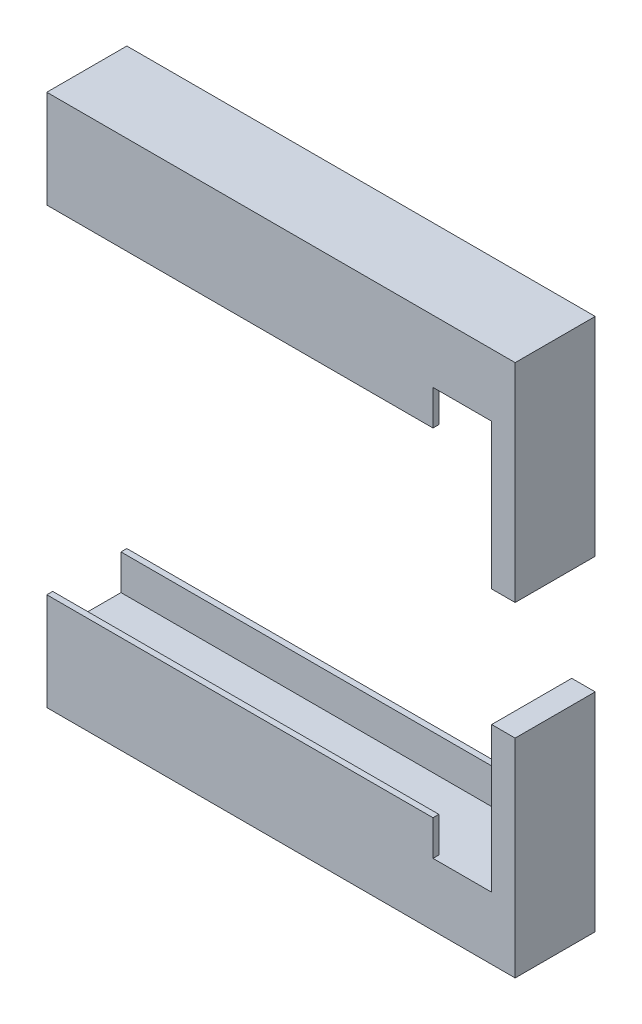
ISO-10303-21;
HEADER;
FILE_DESCRIPTION(('STEP AP214'),'2;1');
FILE_NAME('part.step','',(''),(''),'','','');
FILE_SCHEMA(('AUTOMOTIVE_DESIGN { 1 0 10303 214 1 1 1 1 }'));
ENDSEC;
DATA;
#1=APPLICATION_CONTEXT('core data for automotive mechanical design processes');
#2=APPLICATION_PROTOCOL_DEFINITION('international standard','automotive_design',2000,#1);
#3=PRODUCT_CONTEXT('',#1,'mechanical');
#4=PRODUCT('Part','Part','',(#3));
#5=PRODUCT_RELATED_PRODUCT_CATEGORY('part','',(#4));
#6=PRODUCT_DEFINITION_FORMATION('','',#4);
#7=PRODUCT_DEFINITION_CONTEXT('part definition',#1,'design');
#8=PRODUCT_DEFINITION('design','',#6,#7);
#9=PRODUCT_DEFINITION_SHAPE('','',#8);
#10=(LENGTH_UNIT() NAMED_UNIT(*) SI_UNIT(.MILLI.,.METRE.));
#11=(NAMED_UNIT(*) PLANE_ANGLE_UNIT() SI_UNIT($,.RADIAN.));
#12=(NAMED_UNIT(*) SI_UNIT($,.STERADIAN.) SOLID_ANGLE_UNIT());
#13=UNCERTAINTY_MEASURE_WITH_UNIT(LENGTH_MEASURE(1.E-05),#10,'distance_accuracy_value','');
#14=(GEOMETRIC_REPRESENTATION_CONTEXT(3) GLOBAL_UNCERTAINTY_ASSIGNED_CONTEXT((#13)) GLOBAL_UNIT_ASSIGNED_CONTEXT((#10,
#11,#12)) REPRESENTATION_CONTEXT('',''));
#15=CARTESIAN_POINT('',(0.,0.,0.));
#16=DIRECTION('',(0.,0.,1.));
#17=DIRECTION('',(1.,0.,0.));
#18=AXIS2_PLACEMENT_3D('',#15,#16,#17);
#19=CARTESIAN_POINT('',(39.9,0.,0.));
#20=DIRECTION('',(0.,0.,-1.));
#21=DIRECTION('',(-1.,0.,0.));
#22=AXIS2_PLACEMENT_3D('',#19,#20,#21);
#23=PLANE('',#22);
#24=DIRECTION('',(0.,-1.,0.));
#25=VECTOR('',#24,1.);
#26=CARTESIAN_POINT('',(37.9,37.076,0.));
#27=LINE('',#26,#25);
#28=CARTESIAN_POINT('',(37.9,40.076,0.));
#29=VERTEX_POINT('',#28);
#30=CARTESIAN_POINT('',(37.9,27.701,0.));
#31=VERTEX_POINT('',#30);
#32=EDGE_CURVE('E169',#29,#31,#27,.T.);
#33=ORIENTED_EDGE('',*,*,#32,.T.);
#34=DIRECTION('',(1.,0.,0.));
#35=VECTOR('',#34,1.);
#36=CARTESIAN_POINT('',(-0.001000000000001,27.701,0.));
#37=LINE('',#36,#35);
#38=CARTESIAN_POINT('',(39.9,27.701,0.));
#39=VERTEX_POINT('',#38);
#40=EDGE_CURVE('E71',#31,#39,#37,.T.);
#41=ORIENTED_EDGE('',*,*,#40,.T.);
#42=DIRECTION('',(0.,-1.,0.));
#43=VECTOR('',#42,1.);
#44=CARTESIAN_POINT('',(39.9,0.,0.));
#45=LINE('',#44,#43);
#46=CARTESIAN_POINT('',(39.9,45.402,0.));
#47=VERTEX_POINT('',#46);
#48=EDGE_CURVE('E150',#47,#39,#45,.T.);
#49=ORIENTED_EDGE('',*,*,#48,.F.);
#50=DIRECTION('',(-1.,0.,0.));
#51=VECTOR('',#50,1.);
#52=CARTESIAN_POINT('',(39.9,45.402,0.));
#53=LINE('',#52,#51);
#54=CARTESIAN_POINT('',(0.,45.402,0.));
#55=VERTEX_POINT('',#54);
#56=EDGE_CURVE('E168',#47,#55,#53,.T.);
#57=ORIENTED_EDGE('',*,*,#56,.T.);
#58=DIRECTION('',(0.,-1.,0.));
#59=VECTOR('',#58,1.);
#60=CARTESIAN_POINT('',(0.,0.,0.));
#61=LINE('',#60,#59);
#62=CARTESIAN_POINT('',(0.,37.076,0.));
#63=VERTEX_POINT('',#62);
#64=EDGE_CURVE('E164',#55,#63,#61,.T.);
#65=ORIENTED_EDGE('',*,*,#64,.T.);
#66=DIRECTION('',(-1.,0.,0.));
#67=VECTOR('',#66,1.);
#68=CARTESIAN_POINT('',(75.3129199586818,37.076,0.));
#69=LINE('',#68,#67);
#70=CARTESIAN_POINT('',(32.9,37.076,0.));
#71=VERTEX_POINT('',#70);
#72=EDGE_CURVE('E210',#71,#63,#69,.T.);
#73=ORIENTED_EDGE('',*,*,#72,.F.);
#74=DIRECTION('',(0.,-1.,0.));
#75=VECTOR('',#74,1.);
#76=CARTESIAN_POINT('',(32.9,40.076,0.));
#77=LINE('',#76,#75);
#78=CARTESIAN_POINT('',(32.9,40.076,0.));
#79=VERTEX_POINT('',#78);
#80=EDGE_CURVE('E53',#79,#71,#77,.T.);
#81=ORIENTED_EDGE('',*,*,#80,.F.);
#82=DIRECTION('',(-1.,0.,0.));
#83=VECTOR('',#82,1.);
#84=CARTESIAN_POINT('',(37.9,40.076,0.));
#85=LINE('',#84,#83);
#86=EDGE_CURVE('E183',#29,#79,#85,.T.);
#87=ORIENTED_EDGE('',*,*,#86,.F.);
#88=EDGE_LOOP('',(#33,#41,#49,#57,#65,#73,#81,#87));
#89=FACE_BOUND('',#88,.T.);
#90=ADVANCED_FACE('F50',(#89),#23,.F.);
#91=CARTESIAN_POINT('',(39.9,0.,-6.82));
#92=DIRECTION('',(0.,0.,1.));
#93=DIRECTION('',(1.,0.,0.));
#94=AXIS2_PLACEMENT_3D('',#91,#92,#93);
#95=PLANE('',#94);
#96=DIRECTION('',(0.,1.,0.));
#97=VECTOR('',#96,1.);
#98=CARTESIAN_POINT('',(39.9,0.,-6.82));
#99=LINE('',#98,#97);
#100=CARTESIAN_POINT('',(39.9,27.701,-6.82));
#101=VERTEX_POINT('',#100);
#102=CARTESIAN_POINT('',(39.9,45.402,-6.82));
#103=VERTEX_POINT('',#102);
#104=EDGE_CURVE('E147',#101,#103,#99,.T.);
#105=ORIENTED_EDGE('',*,*,#104,.F.);
#106=DIRECTION('',(1.,0.,0.));
#107=VECTOR('',#106,1.);
#108=CARTESIAN_POINT('',(-0.001000000000001,27.701,-6.82));
#109=LINE('',#108,#107);
#110=CARTESIAN_POINT('',(37.9,27.701,-6.82));
#111=VERTEX_POINT('',#110);
#112=EDGE_CURVE('E58',#111,#101,#109,.T.);
#113=ORIENTED_EDGE('',*,*,#112,.F.);
#114=DIRECTION('',(0.,1.,0.));
#115=VECTOR('',#114,1.);
#116=CARTESIAN_POINT('',(37.9,37.076,-6.82));
#117=LINE('',#116,#115);
#118=CARTESIAN_POINT('',(37.9,40.076,-6.82));
#119=VERTEX_POINT('',#118);
#120=EDGE_CURVE('E167',#111,#119,#117,.T.);
#121=ORIENTED_EDGE('',*,*,#120,.T.);
#122=DIRECTION('',(-1.,0.,0.));
#123=VECTOR('',#122,1.);
#124=CARTESIAN_POINT('',(37.9,40.076,-6.82));
#125=LINE('',#124,#123);
#126=CARTESIAN_POINT('',(32.9,40.076,-6.82));
#127=VERTEX_POINT('',#126);
#128=EDGE_CURVE('E172',#119,#127,#125,.T.);
#129=ORIENTED_EDGE('',*,*,#128,.T.);
#130=DIRECTION('',(0.,-1.,0.));
#131=VECTOR('',#130,1.);
#132=CARTESIAN_POINT('',(32.9,40.076,-6.82));
#133=LINE('',#132,#131);
#134=CARTESIAN_POINT('',(32.9,37.076,-6.82));
#135=VERTEX_POINT('',#134);
#136=EDGE_CURVE('E173',#127,#135,#133,.T.);
#137=ORIENTED_EDGE('',*,*,#136,.T.);
#138=DIRECTION('',(-1.,0.,0.));
#139=VECTOR('',#138,1.);
#140=CARTESIAN_POINT('',(75.3129199586818,37.076,-6.82));
#141=LINE('',#140,#139);
#142=CARTESIAN_POINT('',(0.,37.076,-6.82));
#143=VERTEX_POINT('',#142);
#144=EDGE_CURVE('E163',#135,#143,#141,.T.);
#145=ORIENTED_EDGE('',*,*,#144,.T.);
#146=DIRECTION('',(0.,1.,0.));
#147=VECTOR('',#146,1.);
#148=CARTESIAN_POINT('',(0.,0.,-6.82));
#149=LINE('',#148,#147);
#150=CARTESIAN_POINT('',(0.,45.402,-6.82));
#151=VERTEX_POINT('',#150);
#152=EDGE_CURVE('E158',#143,#151,#149,.T.);
#153=ORIENTED_EDGE('',*,*,#152,.T.);
#154=DIRECTION('',(-1.,0.,0.));
#155=VECTOR('',#154,1.);
#156=CARTESIAN_POINT('',(39.9,45.402,-6.82));
#157=LINE('',#156,#155);
#158=EDGE_CURVE('E153',#103,#151,#157,.T.);
#159=ORIENTED_EDGE('',*,*,#158,.F.);
#160=EDGE_LOOP('',(#105,#113,#121,#129,#137,#145,#153,#159));
#161=FACE_BOUND('',#160,.T.);
#162=ADVANCED_FACE('F151',(#161),#95,.F.);
#163=CARTESIAN_POINT('',(39.9,0.,0.));
#164=DIRECTION('',(-1.,0.,0.));
#165=DIRECTION('',(0.,0.,1.));
#166=AXIS2_PLACEMENT_3D('',#163,#164,#165);
#167=PLANE('',#166);
#168=ORIENTED_EDGE('',*,*,#48,.T.);
#169=DIRECTION('',(0.,0.,1.));
#170=VECTOR('',#169,1.);
#171=CARTESIAN_POINT('',(39.9,27.701,-6.82));
#172=LINE('',#171,#170);
#173=EDGE_CURVE('E12',#101,#39,#172,.T.);
#174=ORIENTED_EDGE('',*,*,#173,.F.);
#175=ORIENTED_EDGE('',*,*,#104,.T.);
#176=DIRECTION('',(0.,0.,1.));
#177=VECTOR('',#176,1.);
#178=CARTESIAN_POINT('',(39.9,45.402,0.));
#179=LINE('',#178,#177);
#180=EDGE_CURVE('E155',#103,#47,#179,.T.);
#181=ORIENTED_EDGE('',*,*,#180,.T.);
#182=EDGE_LOOP('',(#168,#174,#175,#181));
#183=FACE_BOUND('',#182,.T.);
#184=ADVANCED_FACE('F146',(#183),#167,.F.);
#185=CARTESIAN_POINT('',(37.9,0.,0.));
#186=DIRECTION('',(-1.,0.,0.));
#187=DIRECTION('',(0.,0.,1.));
#188=AXIS2_PLACEMENT_3D('',#185,#186,#187);
#189=PLANE('',#188);
#190=DIRECTION('',(0.,0.,1.));
#191=VECTOR('',#190,1.);
#192=CARTESIAN_POINT('',(37.9,27.701,-6.82));
#193=LINE('',#192,#191);
#194=EDGE_CURVE('E66',#111,#31,#193,.T.);
#195=ORIENTED_EDGE('',*,*,#194,.T.);
#196=ORIENTED_EDGE('',*,*,#32,.F.);
#197=DIRECTION('',(0.,0.,1.));
#198=VECTOR('',#197,1.);
#199=CARTESIAN_POINT('',(37.9,40.076,-0.5));
#200=LINE('',#199,#198);
#201=EDGE_CURVE('E224',#119,#29,#200,.T.);
#202=ORIENTED_EDGE('',*,*,#201,.F.);
#203=ORIENTED_EDGE('',*,*,#120,.F.);
#204=EDGE_LOOP('',(#195,#196,#202,#203));
#205=FACE_BOUND('',#204,.T.);
#206=ADVANCED_FACE('F267',(#205),#189,.T.);
#207=CARTESIAN_POINT('',(39.9,45.402,0.));
#208=DIRECTION('',(0.,-1.,0.));
#209=DIRECTION('',(0.,0.,-1.));
#210=AXIS2_PLACEMENT_3D('',#207,#208,#209);
#211=PLANE('',#210);
#212=DIRECTION('',(0.,0.,1.));
#213=VECTOR('',#212,1.);
#214=CARTESIAN_POINT('',(0.,45.402,0.));
#215=LINE('',#214,#213);
#216=EDGE_CURVE('E197',#151,#55,#215,.T.);
#217=ORIENTED_EDGE('',*,*,#216,.T.);
#218=ORIENTED_EDGE('',*,*,#56,.F.);
#219=ORIENTED_EDGE('',*,*,#180,.F.);
#220=ORIENTED_EDGE('',*,*,#158,.T.);
#221=EDGE_LOOP('',(#217,#218,#219,#220));
#222=FACE_BOUND('',#221,.T.);
#223=ADVANCED_FACE('F276',(#222),#211,.F.);
#224=CARTESIAN_POINT('',(0.,0.,0.));
#225=DIRECTION('',(-1.,0.,0.));
#226=DIRECTION('',(0.,0.,1.));
#227=AXIS2_PLACEMENT_3D('',#224,#225,#226);
#228=PLANE('',#227);
#229=CARTESIAN_POINT('',(0.,43.902,-3.41));
#230=DIRECTION('',(-1.,0.,0.));
#231=DIRECTION('',(0.,0.,1.));
#232=AXIS2_PLACEMENT_3D('',#229,#230,#231);
#233=CIRCLE('',#232,0.996949999999996);
#234=CARTESIAN_POINT('',(0.,43.902,-2.41305));
#235=VERTEX_POINT('',#234);
#236=EDGE_CURVE('E142',#235,#235,#233,.T.);
#237=ORIENTED_EDGE('',*,*,#236,.F.);
#238=EDGE_LOOP('',(#237));
#239=FACE_BOUND('',#238,.T.);
#240=DIRECTION('',(0.,0.,-1.));
#241=VECTOR('',#240,1.);
#242=CARTESIAN_POINT('',(0.,37.076,-0.5));
#243=LINE('',#242,#241);
#244=CARTESIAN_POINT('',(0.,37.076,-0.5));
#245=VERTEX_POINT('',#244);
#246=EDGE_CURVE('E212',#63,#245,#243,.T.);
#247=ORIENTED_EDGE('',*,*,#246,.F.);
#248=ORIENTED_EDGE('',*,*,#64,.F.);
#249=ORIENTED_EDGE('',*,*,#216,.F.);
#250=ORIENTED_EDGE('',*,*,#152,.F.);
#251=DIRECTION('',(0.,0.,-1.));
#252=VECTOR('',#251,1.);
#253=CARTESIAN_POINT('',(0.,37.076,-6.82));
#254=LINE('',#253,#252);
#255=CARTESIAN_POINT('',(0.,37.076,-6.32));
#256=VERTEX_POINT('',#255);
#257=EDGE_CURVE('E207',#256,#143,#254,.T.);
#258=ORIENTED_EDGE('',*,*,#257,.F.);
#259=DIRECTION('',(0.,-1.,0.));
#260=VECTOR('',#259,1.);
#261=CARTESIAN_POINT('',(0.,37.076,-6.32));
#262=LINE('',#261,#260);
#263=CARTESIAN_POINT('',(0.,40.076,-6.32));
#264=VERTEX_POINT('',#263);
#265=EDGE_CURVE('E204',#264,#256,#262,.T.);
#266=ORIENTED_EDGE('',*,*,#265,.F.);
#267=DIRECTION('',(0.,0.,-1.));
#268=VECTOR('',#267,1.);
#269=CARTESIAN_POINT('',(0.,40.076,-6.32));
#270=LINE('',#269,#268);
#271=CARTESIAN_POINT('',(0.,40.076,-0.5));
#272=VERTEX_POINT('',#271);
#273=EDGE_CURVE('E201',#272,#264,#270,.T.);
#274=ORIENTED_EDGE('',*,*,#273,.F.);
#275=DIRECTION('',(0.,1.,0.));
#276=VECTOR('',#275,1.);
#277=CARTESIAN_POINT('',(0.,37.076,-0.5));
#278=LINE('',#277,#276);
#279=EDGE_CURVE('E216',#245,#272,#278,.T.);
#280=ORIENTED_EDGE('',*,*,#279,.F.);
#281=EDGE_LOOP('',(#247,#248,#249,#250,#258,#266,#274,#280));
#282=FACE_BOUND('',#281,.T.);
#283=ADVANCED_FACE('F253',(#239,#282),#228,.T.);
#284=CARTESIAN_POINT('',(75.3129199586818,37.076,-0.5));
#285=DIRECTION('',(0.,0.,1.));
#286=DIRECTION('',(1.,0.,0.));
#287=AXIS2_PLACEMENT_3D('',#284,#285,#286);
#288=PLANE('',#287);
#289=DIRECTION('',(-1.,0.,0.));
#290=VECTOR('',#289,1.);
#291=CARTESIAN_POINT('',(75.3129199586818,40.076,-0.5));
#292=LINE('',#291,#290);
#293=CARTESIAN_POINT('',(32.9,40.076,-0.5));
#294=VERTEX_POINT('',#293);
#295=EDGE_CURVE('E199',#294,#272,#292,.T.);
#296=ORIENTED_EDGE('',*,*,#295,.F.);
#297=DIRECTION('',(0.,-1.,0.));
#298=VECTOR('',#297,1.);
#299=CARTESIAN_POINT('',(32.9,37.076,-0.5));
#300=LINE('',#299,#298);
#301=CARTESIAN_POINT('',(32.9,37.076,-0.5));
#302=VERTEX_POINT('',#301);
#303=EDGE_CURVE('E217',#294,#302,#300,.T.);
#304=ORIENTED_EDGE('',*,*,#303,.T.);
#305=DIRECTION('',(-1.,0.,0.));
#306=VECTOR('',#305,1.);
#307=CARTESIAN_POINT('',(75.3129199586818,37.076,-0.5));
#308=LINE('',#307,#306);
#309=EDGE_CURVE('E214',#302,#245,#308,.T.);
#310=ORIENTED_EDGE('',*,*,#309,.T.);
#311=ORIENTED_EDGE('',*,*,#279,.T.);
#312=EDGE_LOOP('',(#296,#304,#310,#311));
#313=FACE_BOUND('',#312,.T.);
#314=ADVANCED_FACE('F260',(#313),#288,.F.);
#315=CARTESIAN_POINT('',(75.3129199586818,37.076,-0.5));
#316=DIRECTION('',(0.,1.,0.));
#317=DIRECTION('',(0.,0.,1.));
#318=AXIS2_PLACEMENT_3D('',#315,#316,#317);
#319=PLANE('',#318);
#320=ORIENTED_EDGE('',*,*,#309,.F.);
#321=DIRECTION('',(0.,0.,1.));
#322=VECTOR('',#321,1.);
#323=CARTESIAN_POINT('',(32.9,37.076,-0.5));
#324=LINE('',#323,#322);
#325=EDGE_CURVE('E213',#302,#71,#324,.T.);
#326=ORIENTED_EDGE('',*,*,#325,.T.);
#327=ORIENTED_EDGE('',*,*,#72,.T.);
#328=ORIENTED_EDGE('',*,*,#246,.T.);
#329=EDGE_LOOP('',(#320,#326,#327,#328));
#330=FACE_BOUND('',#329,.T.);
#331=ADVANCED_FACE('F249',(#330),#319,.F.);
#332=CARTESIAN_POINT('',(75.3129199586818,37.076,-6.82));
#333=DIRECTION('',(0.,1.,0.));
#334=DIRECTION('',(0.,0.,1.));
#335=AXIS2_PLACEMENT_3D('',#332,#333,#334);
#336=PLANE('',#335);
#337=ORIENTED_EDGE('',*,*,#144,.F.);
#338=DIRECTION('',(0.,0.,1.));
#339=VECTOR('',#338,1.);
#340=CARTESIAN_POINT('',(32.9,37.076,-6.82));
#341=LINE('',#340,#339);
#342=CARTESIAN_POINT('',(32.9,37.076,-6.32));
#343=VERTEX_POINT('',#342);
#344=EDGE_CURVE('E208',#135,#343,#341,.T.);
#345=ORIENTED_EDGE('',*,*,#344,.T.);
#346=DIRECTION('',(-1.,0.,0.));
#347=VECTOR('',#346,1.);
#348=CARTESIAN_POINT('',(75.3129199586818,37.076,-6.32));
#349=LINE('',#348,#347);
#350=EDGE_CURVE('E206',#343,#256,#349,.T.);
#351=ORIENTED_EDGE('',*,*,#350,.T.);
#352=ORIENTED_EDGE('',*,*,#257,.T.);
#353=EDGE_LOOP('',(#337,#345,#351,#352));
#354=FACE_BOUND('',#353,.T.);
#355=ADVANCED_FACE('F271',(#354),#336,.F.);
#356=CARTESIAN_POINT('',(75.3129199586818,37.076,-6.32));
#357=DIRECTION('',(0.,0.,-1.));
#358=DIRECTION('',(-1.,0.,0.));
#359=AXIS2_PLACEMENT_3D('',#356,#357,#358);
#360=PLANE('',#359);
#361=ORIENTED_EDGE('',*,*,#350,.F.);
#362=DIRECTION('',(0.,1.,0.));
#363=VECTOR('',#362,1.);
#364=CARTESIAN_POINT('',(32.9,37.076,-6.32));
#365=LINE('',#364,#363);
#366=CARTESIAN_POINT('',(32.9,40.076,-6.32));
#367=VERTEX_POINT('',#366);
#368=EDGE_CURVE('E205',#343,#367,#365,.T.);
#369=ORIENTED_EDGE('',*,*,#368,.T.);
#370=DIRECTION('',(-1.,0.,0.));
#371=VECTOR('',#370,1.);
#372=CARTESIAN_POINT('',(75.3129199586818,40.076,-6.32));
#373=LINE('',#372,#371);
#374=EDGE_CURVE('E202',#367,#264,#373,.T.);
#375=ORIENTED_EDGE('',*,*,#374,.T.);
#376=ORIENTED_EDGE('',*,*,#265,.T.);
#377=EDGE_LOOP('',(#361,#369,#375,#376));
#378=FACE_BOUND('',#377,.T.);
#379=ADVANCED_FACE('F273',(#378),#360,.F.);
#380=CARTESIAN_POINT('',(75.3129199586818,40.076,-6.32));
#381=DIRECTION('',(0.,1.,0.));
#382=DIRECTION('',(0.,0.,1.));
#383=AXIS2_PLACEMENT_3D('',#380,#381,#382);
#384=PLANE('',#383);
#385=ORIENTED_EDGE('',*,*,#374,.F.);
#386=DIRECTION('',(0.,0.,1.));
#387=VECTOR('',#386,1.);
#388=CARTESIAN_POINT('',(32.9,40.076,-6.82));
#389=LINE('',#388,#387);
#390=EDGE_CURVE('E227',#127,#367,#389,.T.);
#391=ORIENTED_EDGE('',*,*,#390,.F.);
#392=ORIENTED_EDGE('',*,*,#128,.F.);
#393=ORIENTED_EDGE('',*,*,#201,.T.);
#394=ORIENTED_EDGE('',*,*,#86,.T.);
#395=EDGE_CURVE('E238',#294,#79,#389,.T.);
#396=ORIENTED_EDGE('',*,*,#395,.F.);
#397=ORIENTED_EDGE('',*,*,#295,.T.);
#398=ORIENTED_EDGE('',*,*,#273,.T.);
#399=EDGE_LOOP('',(#385,#391,#392,#393,#394,#396,#397,#398));
#400=FACE_BOUND('',#399,.T.);
#401=ADVANCED_FACE('F263',(#400),#384,.F.);
#402=CARTESIAN_POINT('',(32.9,40.076,-6.82));
#403=DIRECTION('',(-1.,0.,0.));
#404=DIRECTION('',(0.,-1.,0.));
#405=AXIS2_PLACEMENT_3D('',#402,#403,#404);
#406=PLANE('',#405);
#407=ORIENTED_EDGE('',*,*,#136,.F.);
#408=ORIENTED_EDGE('',*,*,#390,.T.);
#409=ORIENTED_EDGE('',*,*,#368,.F.);
#410=ORIENTED_EDGE('',*,*,#344,.F.);
#411=EDGE_LOOP('',(#407,#408,#409,#410));
#412=FACE_BOUND('',#411,.T.);
#413=ADVANCED_FACE('F268',(#412),#406,.F.);
#414=ORIENTED_EDGE('',*,*,#395,.T.);
#415=ORIENTED_EDGE('',*,*,#80,.T.);
#416=ORIENTED_EDGE('',*,*,#325,.F.);
#417=ORIENTED_EDGE('',*,*,#303,.F.);
#418=EDGE_LOOP('',(#414,#415,#416,#417));
#419=FACE_BOUND('',#418,.T.);
#420=ADVANCED_FACE('F244',(#419),#406,.F.);
#421=CARTESIAN_POINT('',(7.671,43.902,-3.41));
#422=DIRECTION('',(-1.,0.,0.));
#423=DIRECTION('',(0.,0.,1.));
#424=AXIS2_PLACEMENT_3D('',#421,#422,#423);
#425=CONICAL_SURFACE('',#424,0.996949999999996,1.02974425867665);
#426=CARTESIAN_POINT('',(8.27002799413953,43.902,-3.41));
#427=VERTEX_POINT('',#426);
#428=VERTEX_LOOP('',#427);
#429=FACE_BOUND('',#428,.T.);
#430=CARTESIAN_POINT('',(7.671,43.902,-3.41));
#431=DIRECTION('',(-1.,0.,0.));
#432=DIRECTION('',(0.,0.,1.));
#433=AXIS2_PLACEMENT_3D('',#430,#431,#432);
#434=CIRCLE('',#433,0.996949999999996);
#435=CARTESIAN_POINT('',(7.671,43.902,-2.41305));
#436=VERTEX_POINT('',#435);
#437=EDGE_CURVE('E185',#436,#436,#434,.T.);
#438=ORIENTED_EDGE('',*,*,#437,.T.);
#439=EDGE_LOOP('',(#438));
#440=FACE_BOUND('',#439,.T.);
#441=ADVANCED_FACE('F298',(#429,#440),#425,.F.);
#442=CARTESIAN_POINT('',(0.,43.902,-3.41));
#443=DIRECTION('',(-1.,0.,0.));
#444=DIRECTION('',(0.,0.,1.));
#445=AXIS2_PLACEMENT_3D('',#442,#443,#444);
#446=CYLINDRICAL_SURFACE('',#445,0.996949999999996);
#447=ORIENTED_EDGE('',*,*,#437,.F.);
#448=EDGE_LOOP('',(#447));
#449=FACE_BOUND('',#448,.T.);
#450=ORIENTED_EDGE('',*,*,#236,.T.);
#451=EDGE_LOOP('',(#450));
#452=FACE_BOUND('',#451,.T.);
#453=ADVANCED_FACE('F301',(#449,#452),#446,.F.);
#454=CARTESIAN_POINT('',(-0.001000000000001,27.701,-6.82));
#455=DIRECTION('',(0.,1.,0.));
#456=DIRECTION('',(0.,0.,1.));
#457=AXIS2_PLACEMENT_3D('',#454,#455,#456);
#458=PLANE('',#457);
#459=ORIENTED_EDGE('',*,*,#112,.T.);
#460=ORIENTED_EDGE('',*,*,#173,.T.);
#461=ORIENTED_EDGE('',*,*,#40,.F.);
#462=ORIENTED_EDGE('',*,*,#194,.F.);
#463=EDGE_LOOP('',(#459,#460,#461,#462));
#464=FACE_BOUND('',#463,.T.);
#465=ADVANCED_FACE('F138',(#464),#458,.F.);
#466=CLOSED_SHELL('',(#90,#162,#184,#206,#223,#283,#314,#331,#355,#379,#401,#413,#420,#441,#453,#465));
#467=MANIFOLD_SOLID_BREP('B2',#466);
#468=CARTESIAN_POINT('',(7.671,1.5,-3.40999999999999));
#469=DIRECTION('',(-1.,0.,0.));
#470=DIRECTION('',(0.,0.,1.));
#471=AXIS2_PLACEMENT_3D('',#468,#469,#470);
#472=CONICAL_SURFACE('',#471,0.996949999999999,1.02974425867665);
#473=CARTESIAN_POINT('',(8.27002799413953,1.49999999999999,-3.40999999999999));
#474=VERTEX_POINT('',#473);
#475=VERTEX_LOOP('',#474);
#476=FACE_BOUND('',#475,.T.);
#477=CARTESIAN_POINT('',(7.671,1.5,-3.40999999999999));
#478=DIRECTION('',(-1.,0.,0.));
#479=DIRECTION('',(0.,0.,1.));
#480=AXIS2_PLACEMENT_3D('',#477,#478,#479);
#481=CIRCLE('',#480,0.996949999999999);
#482=CARTESIAN_POINT('',(7.671,1.5,-2.41305));
#483=VERTEX_POINT('',#482);
#484=EDGE_CURVE('E636',#483,#483,#481,.T.);
#485=ORIENTED_EDGE('',*,*,#484,.T.);
#486=EDGE_LOOP('',(#485));
#487=FACE_BOUND('',#486,.T.);
#488=ADVANCED_FACE('F446',(#476,#487),#472,.F.);
#489=CARTESIAN_POINT('',(0.,1.5,-3.40999999999999));
#490=DIRECTION('',(-1.,0.,0.));
#491=DIRECTION('',(0.,0.,1.));
#492=AXIS2_PLACEMENT_3D('',#489,#490,#491);
#493=CYLINDRICAL_SURFACE('',#492,0.996949999999999);
#494=ORIENTED_EDGE('',*,*,#484,.F.);
#495=EDGE_LOOP('',(#494));
#496=FACE_BOUND('',#495,.T.);
#497=CARTESIAN_POINT('',(0.,1.5,-3.40999999999999));
#498=DIRECTION('',(-1.,0.,0.));
#499=DIRECTION('',(0.,0.,1.));
#500=AXIS2_PLACEMENT_3D('',#497,#498,#499);
#501=CIRCLE('',#500,0.996949999999999);
#502=CARTESIAN_POINT('',(0.,1.5,-2.41304999999999));
#503=VERTEX_POINT('',#502);
#504=EDGE_CURVE('E544',#503,#503,#501,.T.);
#505=ORIENTED_EDGE('',*,*,#504,.T.);
#506=EDGE_LOOP('',(#505));
#507=FACE_BOUND('',#506,.T.);
#508=ADVANCED_FACE('F681',(#496,#507),#493,.F.);
#509=CARTESIAN_POINT('',(75.3129199586818,5.326,-6.32));
#510=DIRECTION('',(0.,0.,-1.));
#511=DIRECTION('',(0.,1.,0.));
#512=AXIS2_PLACEMENT_3D('',#509,#510,#511);
#513=PLANE('',#512);
#514=DIRECTION('',(-1.,0.,0.));
#515=VECTOR('',#514,1.);
#516=CARTESIAN_POINT('',(75.3129199586818,5.326,-6.32));
#517=LINE('',#516,#515);
#518=CARTESIAN_POINT('',(32.9,5.326,-6.32));
#519=VERTEX_POINT('',#518);
#520=CARTESIAN_POINT('',(0.,5.326,-6.32));
#521=VERTEX_POINT('',#520);
#522=EDGE_CURVE('E586',#519,#521,#517,.T.);
#523=ORIENTED_EDGE('',*,*,#522,.F.);
#524=DIRECTION('',(0.,1.,0.));
#525=VECTOR('',#524,1.);
#526=CARTESIAN_POINT('',(32.9,5.32599999999999,-6.32));
#527=LINE('',#526,#525);
#528=CARTESIAN_POINT('',(32.9,8.326,-6.32));
#529=VERTEX_POINT('',#528);
#530=EDGE_CURVE('E644',#519,#529,#527,.T.);
#531=ORIENTED_EDGE('',*,*,#530,.T.);
#532=DIRECTION('',(-1.,0.,0.));
#533=VECTOR('',#532,1.);
#534=CARTESIAN_POINT('',(75.3129199586818,8.326,-6.32));
#535=LINE('',#534,#533);
#536=CARTESIAN_POINT('',(0.,8.326,-6.32));
#537=VERTEX_POINT('',#536);
#538=EDGE_CURVE('E588',#529,#537,#535,.T.);
#539=ORIENTED_EDGE('',*,*,#538,.T.);
#540=DIRECTION('',(0.,-1.,0.));
#541=VECTOR('',#540,1.);
#542=CARTESIAN_POINT('',(0.,5.326,-6.32));
#543=LINE('',#542,#541);
#544=EDGE_CURVE('E561',#537,#521,#543,.T.);
#545=ORIENTED_EDGE('',*,*,#544,.T.);
#546=EDGE_LOOP('',(#523,#531,#539,#545));
#547=FACE_BOUND('',#546,.T.);
#548=ADVANCED_FACE('F668',(#547),#513,.F.);
#549=CARTESIAN_POINT('',(75.3129199586818,5.326,-0.5));
#550=DIRECTION('',(0.,0.,1.));
#551=DIRECTION('',(1.,0.,0.));
#552=AXIS2_PLACEMENT_3D('',#549,#550,#551);
#553=PLANE('',#552);
#554=DIRECTION('',(-1.,0.,0.));
#555=VECTOR('',#554,1.);
#556=CARTESIAN_POINT('',(75.3129199586818,8.326,-0.5));
#557=LINE('',#556,#555);
#558=CARTESIAN_POINT('',(32.9,8.326,-0.5));
#559=VERTEX_POINT('',#558);
#560=CARTESIAN_POINT('',(0.,8.326,-0.5));
#561=VERTEX_POINT('',#560);
#562=EDGE_CURVE('E582',#559,#561,#557,.T.);
#563=ORIENTED_EDGE('',*,*,#562,.F.);
#564=DIRECTION('',(0.,-1.,0.));
#565=VECTOR('',#564,1.);
#566=CARTESIAN_POINT('',(32.9,5.32599999999999,-0.5));
#567=LINE('',#566,#565);
#568=CARTESIAN_POINT('',(32.9,5.326,-0.5));
#569=VERTEX_POINT('',#568);
#570=EDGE_CURVE('E647',#559,#569,#567,.T.);
#571=ORIENTED_EDGE('',*,*,#570,.T.);
#572=DIRECTION('',(-1.,0.,0.));
#573=VECTOR('',#572,1.);
#574=CARTESIAN_POINT('',(75.3129199586818,5.326,-0.5));
#575=LINE('',#574,#573);
#576=CARTESIAN_POINT('',(0.,5.326,-0.5));
#577=VERTEX_POINT('',#576);
#578=EDGE_CURVE('E584',#569,#577,#575,.T.);
#579=ORIENTED_EDGE('',*,*,#578,.T.);
#580=DIRECTION('',(0.,1.,0.));
#581=VECTOR('',#580,1.);
#582=CARTESIAN_POINT('',(0.,5.326,-0.5));
#583=LINE('',#582,#581);
#584=EDGE_CURVE('E572',#577,#561,#583,.T.);
#585=ORIENTED_EDGE('',*,*,#584,.T.);
#586=EDGE_LOOP('',(#563,#571,#579,#585));
#587=FACE_BOUND('',#586,.T.);
#588=ADVANCED_FACE('F662',(#587),#553,.F.);
#589=CARTESIAN_POINT('',(75.3129199586818,8.326,-0.5));
#590=DIRECTION('',(0.,-1.,0.));
#591=DIRECTION('',(0.,0.,-1.));
#592=AXIS2_PLACEMENT_3D('',#589,#590,#591);
#593=PLANE('',#592);
#594=DIRECTION('',(-1.,0.,0.));
#595=VECTOR('',#594,1.);
#596=CARTESIAN_POINT('',(75.3129199586818,8.326,0.));
#597=LINE('',#596,#595);
#598=CARTESIAN_POINT('',(32.9,8.326,0.));
#599=VERTEX_POINT('',#598);
#600=CARTESIAN_POINT('',(0.,8.326,0.));
#601=VERTEX_POINT('',#600);
#602=EDGE_CURVE('E579',#599,#601,#597,.T.);
#603=ORIENTED_EDGE('',*,*,#602,.F.);
#604=DIRECTION('',(0.,0.,-1.));
#605=VECTOR('',#604,1.);
#606=CARTESIAN_POINT('',(32.9,8.326,-0.5));
#607=LINE('',#606,#605);
#608=EDGE_CURVE('E649',#599,#559,#607,.T.);
#609=ORIENTED_EDGE('',*,*,#608,.T.);
#610=ORIENTED_EDGE('',*,*,#562,.T.);
#611=DIRECTION('',(0.,0.,1.));
#612=VECTOR('',#611,1.);
#613=CARTESIAN_POINT('',(0.,8.326,-0.5));
#614=LINE('',#613,#612);
#615=EDGE_CURVE('E575',#561,#601,#614,.T.);
#616=ORIENTED_EDGE('',*,*,#615,.T.);
#617=EDGE_LOOP('',(#603,#609,#610,#616));
#618=FACE_BOUND('',#617,.T.);
#619=ADVANCED_FACE('F659',(#618),#593,.F.);
#620=CARTESIAN_POINT('',(32.9,40.076,-6.82));
#621=DIRECTION('',(-1.,0.,0.));
#622=DIRECTION('',(0.,-1.,0.));
#623=AXIS2_PLACEMENT_3D('',#620,#621,#622);
#624=PLANE('',#623);
#625=DIRECTION('',(0.,-1.,0.));
#626=VECTOR('',#625,1.);
#627=CARTESIAN_POINT('',(32.9,40.076,0.));
#628=LINE('',#627,#626);
#629=CARTESIAN_POINT('',(32.9,5.326,0.));
#630=VERTEX_POINT('',#629);
#631=EDGE_CURVE('E633',#599,#630,#628,.T.);
#632=ORIENTED_EDGE('',*,*,#631,.T.);
#633=DIRECTION('',(0.,0.,1.));
#634=VECTOR('',#633,1.);
#635=CARTESIAN_POINT('',(32.9,5.326,-6.82));
#636=LINE('',#635,#634);
#637=EDGE_CURVE('E469',#569,#630,#636,.T.);
#638=ORIENTED_EDGE('',*,*,#637,.F.);
#639=ORIENTED_EDGE('',*,*,#570,.F.);
#640=ORIENTED_EDGE('',*,*,#608,.F.);
#641=EDGE_LOOP('',(#632,#638,#639,#640));
#642=FACE_BOUND('',#641,.T.);
#643=ADVANCED_FACE('F670',(#642),#624,.F.);
#644=CARTESIAN_POINT('',(32.9,5.326,-6.82));
#645=VERTEX_POINT('',#644);
#646=EDGE_CURVE('E640',#645,#519,#636,.T.);
#647=ORIENTED_EDGE('',*,*,#646,.F.);
#648=DIRECTION('',(0.,-1.,0.));
#649=VECTOR('',#648,1.);
#650=CARTESIAN_POINT('',(32.9,40.076,-6.82));
#651=LINE('',#650,#649);
#652=CARTESIAN_POINT('',(32.9,8.326,-6.82));
#653=VERTEX_POINT('',#652);
#654=EDGE_CURVE('E626',#653,#645,#651,.T.);
#655=ORIENTED_EDGE('',*,*,#654,.F.);
#656=DIRECTION('',(0.,0.,-1.));
#657=VECTOR('',#656,1.);
#658=CARTESIAN_POINT('',(32.9,8.326,-6.82));
#659=LINE('',#658,#657);
#660=EDGE_CURVE('E623',#529,#653,#659,.T.);
#661=ORIENTED_EDGE('',*,*,#660,.F.);
#662=ORIENTED_EDGE('',*,*,#530,.F.);
#663=EDGE_LOOP('',(#647,#655,#661,#662));
#664=FACE_BOUND('',#663,.T.);
#665=ADVANCED_FACE('F669',(#664),#624,.F.);
#666=CARTESIAN_POINT('',(75.3129199586818,8.326,-6.82));
#667=DIRECTION('',(0.,-1.,0.));
#668=DIRECTION('',(0.,0.,-1.));
#669=AXIS2_PLACEMENT_3D('',#666,#667,#668);
#670=PLANE('',#669);
#671=ORIENTED_EDGE('',*,*,#538,.F.);
#672=ORIENTED_EDGE('',*,*,#660,.T.);
#673=DIRECTION('',(-1.,0.,0.));
#674=VECTOR('',#673,1.);
#675=CARTESIAN_POINT('',(75.3129199586818,8.326,-6.82));
#676=LINE('',#675,#674);
#677=CARTESIAN_POINT('',(0.,8.326,-6.82));
#678=VERTEX_POINT('',#677);
#679=EDGE_CURVE('E578',#653,#678,#676,.T.);
#680=ORIENTED_EDGE('',*,*,#679,.T.);
#681=DIRECTION('',(0.,0.,1.));
#682=VECTOR('',#681,1.);
#683=CARTESIAN_POINT('',(0.,8.326,-6.82));
#684=LINE('',#683,#682);
#685=EDGE_CURVE('E558',#678,#537,#684,.T.);
#686=ORIENTED_EDGE('',*,*,#685,.T.);
#687=EDGE_LOOP('',(#671,#672,#680,#686));
#688=FACE_BOUND('',#687,.T.);
#689=ADVANCED_FACE('F621',(#688),#670,.F.);
#690=CARTESIAN_POINT('',(0.,0.,0.));
#691=DIRECTION('',(-1.,0.,0.));
#692=DIRECTION('',(0.,0.,1.));
#693=AXIS2_PLACEMENT_3D('',#690,#691,#692);
#694=PLANE('',#693);
#695=ORIENTED_EDGE('',*,*,#504,.F.);
#696=EDGE_LOOP('',(#695));
#697=FACE_BOUND('',#696,.T.);
#698=ORIENTED_EDGE('',*,*,#615,.F.);
#699=ORIENTED_EDGE('',*,*,#584,.F.);
#700=DIRECTION('',(0.,0.,1.));
#701=VECTOR('',#700,1.);
#702=CARTESIAN_POINT('',(0.,5.326,-6.32));
#703=LINE('',#702,#701);
#704=EDGE_CURVE('E569',#521,#577,#703,.T.);
#705=ORIENTED_EDGE('',*,*,#704,.F.);
#706=ORIENTED_EDGE('',*,*,#544,.F.);
#707=ORIENTED_EDGE('',*,*,#685,.F.);
#708=DIRECTION('',(0.,1.,0.));
#709=VECTOR('',#708,1.);
#710=CARTESIAN_POINT('',(0.,0.,-6.82));
#711=LINE('',#710,#709);
#712=CARTESIAN_POINT('',(0.,0.,-6.82));
#713=VERTEX_POINT('',#712);
#714=EDGE_CURVE('E593',#713,#678,#711,.T.);
#715=ORIENTED_EDGE('',*,*,#714,.F.);
#716=DIRECTION('',(0.,0.,-1.));
#717=VECTOR('',#716,1.);
#718=CARTESIAN_POINT('',(0.,0.,0.));
#719=LINE('',#718,#717);
#720=CARTESIAN_POINT('',(0.,0.,0.));
#721=VERTEX_POINT('',#720);
#722=EDGE_CURVE('E599',#721,#713,#719,.T.);
#723=ORIENTED_EDGE('',*,*,#722,.F.);
#724=DIRECTION('',(0.,-1.,0.));
#725=VECTOR('',#724,1.);
#726=CARTESIAN_POINT('',(0.,0.,0.));
#727=LINE('',#726,#725);
#728=EDGE_CURVE('E581',#601,#721,#727,.T.);
#729=ORIENTED_EDGE('',*,*,#728,.F.);
#730=EDGE_LOOP('',(#698,#699,#705,#706,#707,#715,#723,#729));
#731=FACE_BOUND('',#730,.T.);
#732=ADVANCED_FACE('F615',(#697,#731),#694,.T.);
#733=CARTESIAN_POINT('',(39.9,0.,0.));
#734=DIRECTION('',(0.,1.,0.));
#735=DIRECTION('',(0.,0.,1.));
#736=AXIS2_PLACEMENT_3D('',#733,#734,#735);
#737=PLANE('',#736);
#738=ORIENTED_EDGE('',*,*,#722,.T.);
#739=DIRECTION('',(-1.,0.,0.));
#740=VECTOR('',#739,1.);
#741=CARTESIAN_POINT('',(39.9,0.,-6.82));
#742=LINE('',#741,#740);
#743=CARTESIAN_POINT('',(39.9,0.,-6.82));
#744=VERTEX_POINT('',#743);
#745=EDGE_CURVE('E454',#744,#713,#742,.T.);
#746=ORIENTED_EDGE('',*,*,#745,.F.);
#747=DIRECTION('',(0.,0.,-1.));
#748=VECTOR('',#747,1.);
#749=CARTESIAN_POINT('',(39.9,0.,0.));
#750=LINE('',#749,#748);
#751=CARTESIAN_POINT('',(39.9,0.,0.));
#752=VERTEX_POINT('',#751);
#753=EDGE_CURVE('E592',#752,#744,#750,.T.);
#754=ORIENTED_EDGE('',*,*,#753,.F.);
#755=DIRECTION('',(-1.,0.,0.));
#756=VECTOR('',#755,1.);
#757=CARTESIAN_POINT('',(39.9,0.,0.));
#758=LINE('',#757,#756);
#759=EDGE_CURVE('E48',#752,#721,#758,.T.);
#760=ORIENTED_EDGE('',*,*,#759,.T.);
#761=EDGE_LOOP('',(#738,#746,#754,#760));
#762=FACE_BOUND('',#761,.T.);
#763=ADVANCED_FACE('F654',(#762),#737,.F.);
#764=CARTESIAN_POINT('',(75.3129199586818,5.326,-6.32));
#765=DIRECTION('',(0.,-1.,0.));
#766=DIRECTION('',(0.,0.,-1.));
#767=AXIS2_PLACEMENT_3D('',#764,#765,#766);
#768=PLANE('',#767);
#769=ORIENTED_EDGE('',*,*,#578,.F.);
#770=ORIENTED_EDGE('',*,*,#637,.T.);
#771=DIRECTION('',(1.,0.,0.));
#772=VECTOR('',#771,1.);
#773=CARTESIAN_POINT('',(37.9,5.326,0.));
#774=LINE('',#773,#772);
#775=CARTESIAN_POINT('',(37.9,5.326,0.));
#776=VERTEX_POINT('',#775);
#777=EDGE_CURVE('E630',#630,#776,#774,.T.);
#778=ORIENTED_EDGE('',*,*,#777,.T.);
#779=DIRECTION('',(0.,0.,-1.));
#780=VECTOR('',#779,1.);
#781=CARTESIAN_POINT('',(37.9,5.326,-6.32));
#782=LINE('',#781,#780);
#783=CARTESIAN_POINT('',(37.9,5.326,-6.82));
#784=VERTEX_POINT('',#783);
#785=EDGE_CURVE('E556',#776,#784,#782,.T.);
#786=ORIENTED_EDGE('',*,*,#785,.T.);
#787=DIRECTION('',(1.,0.,0.));
#788=VECTOR('',#787,1.);
#789=CARTESIAN_POINT('',(37.9,5.326,-6.82));
#790=LINE('',#789,#788);
#791=EDGE_CURVE('E628',#645,#784,#790,.T.);
#792=ORIENTED_EDGE('',*,*,#791,.F.);
#793=ORIENTED_EDGE('',*,*,#646,.T.);
#794=ORIENTED_EDGE('',*,*,#522,.T.);
#795=ORIENTED_EDGE('',*,*,#704,.T.);
#796=EDGE_LOOP('',(#769,#770,#778,#786,#792,#793,#794,#795));
#797=FACE_BOUND('',#796,.T.);
#798=ADVANCED_FACE('F665',(#797),#768,.F.);
#799=CARTESIAN_POINT('',(39.9,0.,0.));
#800=DIRECTION('',(-1.,0.,0.));
#801=DIRECTION('',(0.,0.,1.));
#802=AXIS2_PLACEMENT_3D('',#799,#800,#801);
#803=PLANE('',#802);
#804=DIRECTION('',(0.,1.,0.));
#805=VECTOR('',#804,1.);
#806=CARTESIAN_POINT('',(39.9,0.,-6.82));
#807=LINE('',#806,#805);
#808=CARTESIAN_POINT('',(39.9,17.701,-6.82));
#809=VERTEX_POINT('',#808);
#810=EDGE_CURVE('E595',#744,#809,#807,.T.);
#811=ORIENTED_EDGE('',*,*,#810,.T.);
#812=DIRECTION('',(0.,0.,-1.));
#813=VECTOR('',#812,1.);
#814=CARTESIAN_POINT('',(39.9,17.701,-6.82));
#815=LINE('',#814,#813);
#816=CARTESIAN_POINT('',(39.9,17.701,0.));
#817=VERTEX_POINT('',#816);
#818=EDGE_CURVE('E553',#817,#809,#815,.T.);
#819=ORIENTED_EDGE('',*,*,#818,.F.);
#820=DIRECTION('',(0.,-1.,0.));
#821=VECTOR('',#820,1.);
#822=CARTESIAN_POINT('',(39.9,0.,0.));
#823=LINE('',#822,#821);
#824=EDGE_CURVE('E552',#817,#752,#823,.T.);
#825=ORIENTED_EDGE('',*,*,#824,.T.);
#826=ORIENTED_EDGE('',*,*,#753,.T.);
#827=EDGE_LOOP('',(#811,#819,#825,#826));
#828=FACE_BOUND('',#827,.T.);
#829=ADVANCED_FACE('F653',(#828),#803,.F.);
#830=CARTESIAN_POINT('',(37.9,0.,0.));
#831=DIRECTION('',(-1.,0.,0.));
#832=DIRECTION('',(0.,0.,1.));
#833=AXIS2_PLACEMENT_3D('',#830,#831,#832);
#834=PLANE('',#833);
#835=DIRECTION('',(0.,0.,-1.));
#836=VECTOR('',#835,1.);
#837=CARTESIAN_POINT('',(37.9,17.701,-6.82));
#838=LINE('',#837,#836);
#839=CARTESIAN_POINT('',(37.9,17.701,0.));
#840=VERTEX_POINT('',#839);
#841=CARTESIAN_POINT('',(37.9,17.701,-6.82));
#842=VERTEX_POINT('',#841);
#843=EDGE_CURVE('E535',#840,#842,#838,.T.);
#844=ORIENTED_EDGE('',*,*,#843,.T.);
#845=DIRECTION('',(0.,1.,0.));
#846=VECTOR('',#845,1.);
#847=CARTESIAN_POINT('',(37.9,37.076,-6.82));
#848=LINE('',#847,#846);
#849=EDGE_CURVE('E563',#784,#842,#848,.T.);
#850=ORIENTED_EDGE('',*,*,#849,.F.);
#851=ORIENTED_EDGE('',*,*,#785,.F.);
#852=DIRECTION('',(0.,-1.,0.));
#853=VECTOR('',#852,1.);
#854=CARTESIAN_POINT('',(37.9,37.076,0.));
#855=LINE('',#854,#853);
#856=EDGE_CURVE('E549',#840,#776,#855,.T.);
#857=ORIENTED_EDGE('',*,*,#856,.F.);
#858=EDGE_LOOP('',(#844,#850,#851,#857));
#859=FACE_BOUND('',#858,.T.);
#860=ADVANCED_FACE('F555',(#859),#834,.T.);
#861=CARTESIAN_POINT('',(39.9,0.,-6.82));
#862=DIRECTION('',(0.,0.,1.));
#863=DIRECTION('',(1.,0.,0.));
#864=AXIS2_PLACEMENT_3D('',#861,#862,#863);
#865=PLANE('',#864);
#866=ORIENTED_EDGE('',*,*,#849,.T.);
#867=DIRECTION('',(1.,0.,0.));
#868=VECTOR('',#867,1.);
#869=CARTESIAN_POINT('',(-0.001000000000001,17.701,-6.82));
#870=LINE('',#869,#868);
#871=EDGE_CURVE('E461',#842,#809,#870,.T.);
#872=ORIENTED_EDGE('',*,*,#871,.T.);
#873=ORIENTED_EDGE('',*,*,#810,.F.);
#874=ORIENTED_EDGE('',*,*,#745,.T.);
#875=ORIENTED_EDGE('',*,*,#714,.T.);
#876=ORIENTED_EDGE('',*,*,#679,.F.);
#877=ORIENTED_EDGE('',*,*,#654,.T.);
#878=ORIENTED_EDGE('',*,*,#791,.T.);
#879=EDGE_LOOP('',(#866,#872,#873,#874,#875,#876,#877,#878));
#880=FACE_BOUND('',#879,.T.);
#881=ADVANCED_FACE('F607',(#880),#865,.F.);
#882=CARTESIAN_POINT('',(39.9,0.,0.));
#883=DIRECTION('',(0.,0.,-1.));
#884=DIRECTION('',(-1.,0.,0.));
#885=AXIS2_PLACEMENT_3D('',#882,#883,#884);
#886=PLANE('',#885);
#887=ORIENTED_EDGE('',*,*,#824,.F.);
#888=DIRECTION('',(1.,0.,0.));
#889=VECTOR('',#888,1.);
#890=CARTESIAN_POINT('',(-0.001000000000001,17.701,0.));
#891=LINE('',#890,#889);
#892=EDGE_CURVE('E538',#840,#817,#891,.T.);
#893=ORIENTED_EDGE('',*,*,#892,.F.);
#894=ORIENTED_EDGE('',*,*,#856,.T.);
#895=ORIENTED_EDGE('',*,*,#777,.F.);
#896=ORIENTED_EDGE('',*,*,#631,.F.);
#897=ORIENTED_EDGE('',*,*,#602,.T.);
#898=ORIENTED_EDGE('',*,*,#728,.T.);
#899=ORIENTED_EDGE('',*,*,#759,.F.);
#900=EDGE_LOOP('',(#887,#893,#894,#895,#896,#897,#898,#899));
#901=FACE_BOUND('',#900,.T.);
#902=ADVANCED_FACE('F448',(#901),#886,.F.);
#903=CARTESIAN_POINT('',(-0.001000000000001,17.701,-6.82));
#904=DIRECTION('',(0.,-1.,0.));
#905=DIRECTION('',(0.,0.,-1.));
#906=AXIS2_PLACEMENT_3D('',#903,#904,#905);
#907=PLANE('',#906);
#908=ORIENTED_EDGE('',*,*,#892,.T.);
#909=ORIENTED_EDGE('',*,*,#818,.T.);
#910=ORIENTED_EDGE('',*,*,#871,.F.);
#911=ORIENTED_EDGE('',*,*,#843,.F.);
#912=EDGE_LOOP('',(#908,#909,#910,#911));
#913=FACE_BOUND('',#912,.T.);
#914=ADVANCED_FACE('F537',(#913),#907,.F.);
#915=CLOSED_SHELL('',(#488,#508,#548,#588,#619,#643,#665,#689,#732,#763,#798,#829,#860,#881,
#902,#914));
#916=MANIFOLD_SOLID_BREP('B6',#915);
#917=ADVANCED_BREP_SHAPE_REPRESENTATION('',(#18,#467,#916),#14);
#918=SHAPE_DEFINITION_REPRESENTATION(#9,#917);
ENDSEC;
END-ISO-10303-21;
